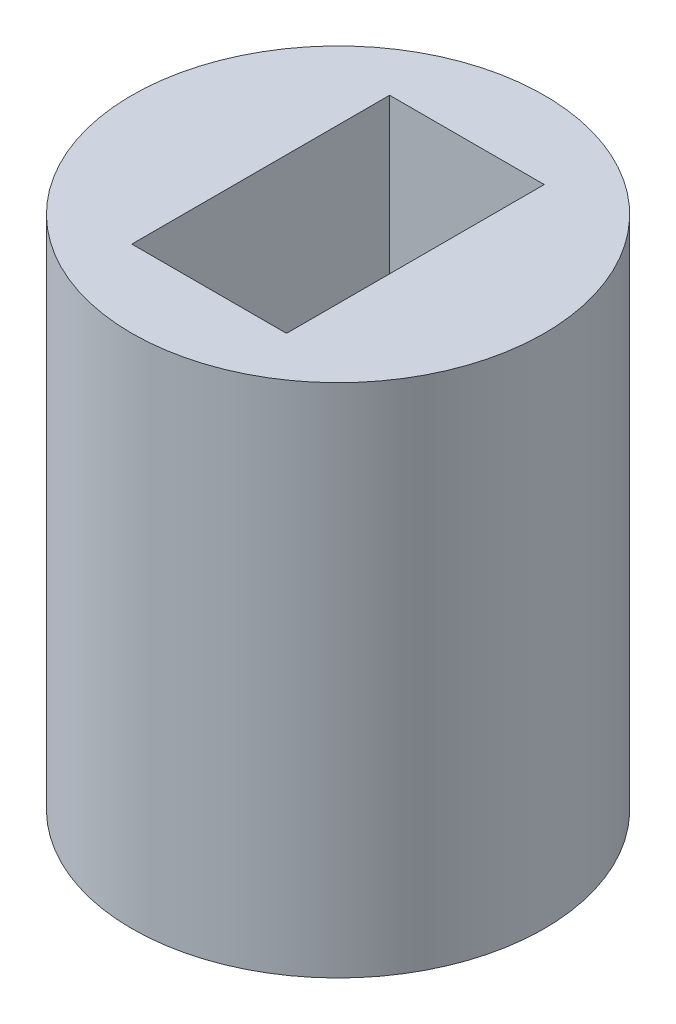
ISO-10303-21;
HEADER;
FILE_DESCRIPTION(('STEP AP214'),'2;1');
FILE_NAME('part.step','',(''),(''),'','','');
FILE_SCHEMA(('AUTOMOTIVE_DESIGN { 1 0 10303 214 1 1 1 1 }'));
ENDSEC;
DATA;
#1=APPLICATION_CONTEXT('core data for automotive mechanical design processes');
#2=APPLICATION_PROTOCOL_DEFINITION('international standard','automotive_design',2000,#1);
#3=PRODUCT_CONTEXT('',#1,'mechanical');
#4=PRODUCT('Part','Part','',(#3));
#5=PRODUCT_RELATED_PRODUCT_CATEGORY('part','',(#4));
#6=PRODUCT_DEFINITION_FORMATION('','',#4);
#7=PRODUCT_DEFINITION_CONTEXT('part definition',#1,'design');
#8=PRODUCT_DEFINITION('design','',#6,#7);
#9=PRODUCT_DEFINITION_SHAPE('','',#8);
#10=(LENGTH_UNIT() NAMED_UNIT(*) SI_UNIT(.MILLI.,.METRE.));
#11=(NAMED_UNIT(*) PLANE_ANGLE_UNIT() SI_UNIT($,.RADIAN.));
#12=(NAMED_UNIT(*) SI_UNIT($,.STERADIAN.) SOLID_ANGLE_UNIT());
#13=UNCERTAINTY_MEASURE_WITH_UNIT(LENGTH_MEASURE(1.E-05),#10,'distance_accuracy_value','');
#14=(GEOMETRIC_REPRESENTATION_CONTEXT(3) GLOBAL_UNCERTAINTY_ASSIGNED_CONTEXT((#13)) GLOBAL_UNIT_ASSIGNED_CONTEXT((#10,
#11,#12)) REPRESENTATION_CONTEXT('',''));
#15=CARTESIAN_POINT('',(0.,0.,0.));
#16=DIRECTION('',(0.,0.,1.));
#17=DIRECTION('',(1.,0.,0.));
#18=AXIS2_PLACEMENT_3D('',#15,#16,#17);
#19=CARTESIAN_POINT('',(0.,10.,0.));
#20=DIRECTION('',(0.,1.,0.));
#21=DIRECTION('',(0.,0.,1.));
#22=AXIS2_PLACEMENT_3D('',#19,#20,#21);
#23=PLANE('',#22);
#24=CARTESIAN_POINT('',(0.,10.,0.));
#25=DIRECTION('',(0.,1.,0.));
#26=DIRECTION('',(0.,0.,1.));
#27=AXIS2_PLACEMENT_3D('',#24,#25,#26);
#28=CIRCLE('',#27,4.);
#29=CARTESIAN_POINT('',(0.,10.,4.));
#30=VERTEX_POINT('',#29);
#31=EDGE_CURVE('E11',#30,#30,#28,.T.);
#32=ORIENTED_EDGE('',*,*,#31,.T.);
#33=EDGE_LOOP('',(#32));
#34=FACE_BOUND('',#33,.T.);
#35=DIRECTION('',(1.,0.,0.));
#36=VECTOR('',#35,1.);
#37=CARTESIAN_POINT('',(-1.5,10.,2.5));
#38=LINE('',#37,#36);
#39=CARTESIAN_POINT('',(-1.5,10.,2.5));
#40=VERTEX_POINT('',#39);
#41=CARTESIAN_POINT('',(1.5,10.,2.5));
#42=VERTEX_POINT('',#41);
#43=EDGE_CURVE('E82',#40,#42,#38,.T.);
#44=ORIENTED_EDGE('',*,*,#43,.F.);
#45=DIRECTION('',(0.,0.,1.));
#46=VECTOR('',#45,1.);
#47=CARTESIAN_POINT('',(-1.5,10.,-2.5));
#48=LINE('',#47,#46);
#49=CARTESIAN_POINT('',(-1.5,10.,-2.5));
#50=VERTEX_POINT('',#49);
#51=EDGE_CURVE('E74',#50,#40,#48,.T.);
#52=ORIENTED_EDGE('',*,*,#51,.F.);
#53=DIRECTION('',(-1.,0.,0.));
#54=VECTOR('',#53,1.);
#55=CARTESIAN_POINT('',(-1.5,10.,-2.5));
#56=LINE('',#55,#54);
#57=CARTESIAN_POINT('',(1.5,10.,-2.5));
#58=VERTEX_POINT('',#57);
#59=EDGE_CURVE('E95',#58,#50,#56,.T.);
#60=ORIENTED_EDGE('',*,*,#59,.F.);
#61=DIRECTION('',(0.,0.,-1.));
#62=VECTOR('',#61,1.);
#63=CARTESIAN_POINT('',(1.5,10.,-2.5));
#64=LINE('',#63,#62);
#65=EDGE_CURVE('E93',#42,#58,#64,.T.);
#66=ORIENTED_EDGE('',*,*,#65,.F.);
#67=EDGE_LOOP('',(#44,#52,#60,#66));
#68=FACE_BOUND('',#67,.T.);
#69=ADVANCED_FACE('F33',(#34,#68),#23,.T.);
#70=CARTESIAN_POINT('',(0.,0.,0.));
#71=DIRECTION('',(0.,1.,0.));
#72=DIRECTION('',(0.,0.,1.));
#73=AXIS2_PLACEMENT_3D('',#70,#71,#72);
#74=PLANE('',#73);
#75=CARTESIAN_POINT('',(0.,0.,0.));
#76=DIRECTION('',(0.,1.,0.));
#77=DIRECTION('',(0.,0.,1.));
#78=AXIS2_PLACEMENT_3D('',#75,#76,#77);
#79=CIRCLE('',#78,4.);
#80=CARTESIAN_POINT('',(0.,0.,4.));
#81=VERTEX_POINT('',#80);
#82=EDGE_CURVE('E37',#81,#81,#79,.T.);
#83=ORIENTED_EDGE('',*,*,#82,.F.);
#84=EDGE_LOOP('',(#83));
#85=FACE_BOUND('',#84,.T.);
#86=DIRECTION('',(0.,0.,1.));
#87=VECTOR('',#86,1.);
#88=CARTESIAN_POINT('',(-1.5,0.,-2.5));
#89=LINE('',#88,#87);
#90=CARTESIAN_POINT('',(-1.5,0.,-2.5));
#91=VERTEX_POINT('',#90);
#92=CARTESIAN_POINT('',(-1.5,0.,2.5));
#93=VERTEX_POINT('',#92);
#94=EDGE_CURVE('E56',#91,#93,#89,.T.);
#95=ORIENTED_EDGE('',*,*,#94,.T.);
#96=DIRECTION('',(1.,0.,0.));
#97=VECTOR('',#96,1.);
#98=CARTESIAN_POINT('',(-1.5,0.,2.5));
#99=LINE('',#98,#97);
#100=CARTESIAN_POINT('',(1.5,0.,2.5));
#101=VERTEX_POINT('',#100);
#102=EDGE_CURVE('E89',#93,#101,#99,.T.);
#103=ORIENTED_EDGE('',*,*,#102,.T.);
#104=DIRECTION('',(0.,0.,-1.));
#105=VECTOR('',#104,1.);
#106=CARTESIAN_POINT('',(1.5,0.,-2.5));
#107=LINE('',#106,#105);
#108=CARTESIAN_POINT('',(1.5,0.,-2.5));
#109=VERTEX_POINT('',#108);
#110=EDGE_CURVE('E101',#101,#109,#107,.T.);
#111=ORIENTED_EDGE('',*,*,#110,.T.);
#112=DIRECTION('',(-1.,0.,0.));
#113=VECTOR('',#112,1.);
#114=CARTESIAN_POINT('',(-1.5,0.,-2.5));
#115=LINE('',#114,#113);
#116=EDGE_CURVE('E83',#109,#91,#115,.T.);
#117=ORIENTED_EDGE('',*,*,#116,.T.);
#118=EDGE_LOOP('',(#95,#103,#111,#117));
#119=FACE_BOUND('',#118,.T.);
#120=ADVANCED_FACE('F112',(#85,#119),#74,.F.);
#121=CARTESIAN_POINT('',(0.,10.,0.));
#122=DIRECTION('',(0.,-1.,0.));
#123=DIRECTION('',(0.,0.,-1.));
#124=AXIS2_PLACEMENT_3D('',#121,#122,#123);
#125=CYLINDRICAL_SURFACE('',#124,4.);
#126=ORIENTED_EDGE('',*,*,#31,.F.);
#127=EDGE_LOOP('',(#126));
#128=FACE_BOUND('',#127,.T.);
#129=ORIENTED_EDGE('',*,*,#82,.T.);
#130=EDGE_LOOP('',(#129));
#131=FACE_BOUND('',#130,.T.);
#132=ADVANCED_FACE('F35',(#128,#131),#125,.T.);
#133=CARTESIAN_POINT('',(-1.5,10.,-2.5));
#134=DIRECTION('',(1.,0.,0.));
#135=DIRECTION('',(0.,0.,-1.));
#136=AXIS2_PLACEMENT_3D('',#133,#134,#135);
#137=PLANE('',#136);
#138=ORIENTED_EDGE('',*,*,#94,.F.);
#139=DIRECTION('',(0.,-1.,0.));
#140=VECTOR('',#139,1.);
#141=CARTESIAN_POINT('',(-1.5,10.,-2.5));
#142=LINE('',#141,#140);
#143=EDGE_CURVE('E78',#50,#91,#142,.T.);
#144=ORIENTED_EDGE('',*,*,#143,.F.);
#145=ORIENTED_EDGE('',*,*,#51,.T.);
#146=DIRECTION('',(0.,-1.,0.));
#147=VECTOR('',#146,1.);
#148=CARTESIAN_POINT('',(-1.5,10.,2.5));
#149=LINE('',#148,#147);
#150=EDGE_CURVE('E77',#40,#93,#149,.T.);
#151=ORIENTED_EDGE('',*,*,#150,.T.);
#152=EDGE_LOOP('',(#138,#144,#145,#151));
#153=FACE_BOUND('',#152,.T.);
#154=ADVANCED_FACE('F76',(#153),#137,.T.);
#155=CARTESIAN_POINT('',(-1.5,10.,2.5));
#156=DIRECTION('',(0.,0.,-1.));
#157=DIRECTION('',(-1.,0.,0.));
#158=AXIS2_PLACEMENT_3D('',#155,#156,#157);
#159=PLANE('',#158);
#160=ORIENTED_EDGE('',*,*,#102,.F.);
#161=ORIENTED_EDGE('',*,*,#150,.F.);
#162=ORIENTED_EDGE('',*,*,#43,.T.);
#163=DIRECTION('',(0.,-1.,0.));
#164=VECTOR('',#163,1.);
#165=CARTESIAN_POINT('',(1.5,10.,2.5));
#166=LINE('',#165,#164);
#167=EDGE_CURVE('E90',#42,#101,#166,.T.);
#168=ORIENTED_EDGE('',*,*,#167,.T.);
#169=EDGE_LOOP('',(#160,#161,#162,#168));
#170=FACE_BOUND('',#169,.T.);
#171=ADVANCED_FACE('F86',(#170),#159,.T.);
#172=CARTESIAN_POINT('',(1.5,10.,-2.5));
#173=DIRECTION('',(-1.,0.,0.));
#174=DIRECTION('',(0.,0.,1.));
#175=AXIS2_PLACEMENT_3D('',#172,#173,#174);
#176=PLANE('',#175);
#177=ORIENTED_EDGE('',*,*,#110,.F.);
#178=ORIENTED_EDGE('',*,*,#167,.F.);
#179=ORIENTED_EDGE('',*,*,#65,.T.);
#180=DIRECTION('',(0.,-1.,0.));
#181=VECTOR('',#180,1.);
#182=CARTESIAN_POINT('',(1.5,10.,-2.5));
#183=LINE('',#182,#181);
#184=EDGE_CURVE('E48',#58,#109,#183,.T.);
#185=ORIENTED_EDGE('',*,*,#184,.T.);
#186=EDGE_LOOP('',(#177,#178,#179,#185));
#187=FACE_BOUND('',#186,.T.);
#188=ADVANCED_FACE('F110',(#187),#176,.T.);
#189=CARTESIAN_POINT('',(-1.5,10.,-2.5));
#190=DIRECTION('',(0.,0.,1.));
#191=DIRECTION('',(1.,0.,0.));
#192=AXIS2_PLACEMENT_3D('',#189,#190,#191);
#193=PLANE('',#192);
#194=ORIENTED_EDGE('',*,*,#116,.F.);
#195=ORIENTED_EDGE('',*,*,#184,.F.);
#196=ORIENTED_EDGE('',*,*,#59,.T.);
#197=ORIENTED_EDGE('',*,*,#143,.T.);
#198=EDGE_LOOP('',(#194,#195,#196,#197));
#199=FACE_BOUND('',#198,.T.);
#200=ADVANCED_FACE('F113',(#199),#193,.T.);
#201=CLOSED_SHELL('',(#69,#120,#132,#154,#171,#188,#200));
#202=MANIFOLD_SOLID_BREP('B2',#201);
#203=ADVANCED_BREP_SHAPE_REPRESENTATION('',(#18,#202),#14);
#204=SHAPE_DEFINITION_REPRESENTATION(#9,#203);
ENDSEC;
END-ISO-10303-21;
